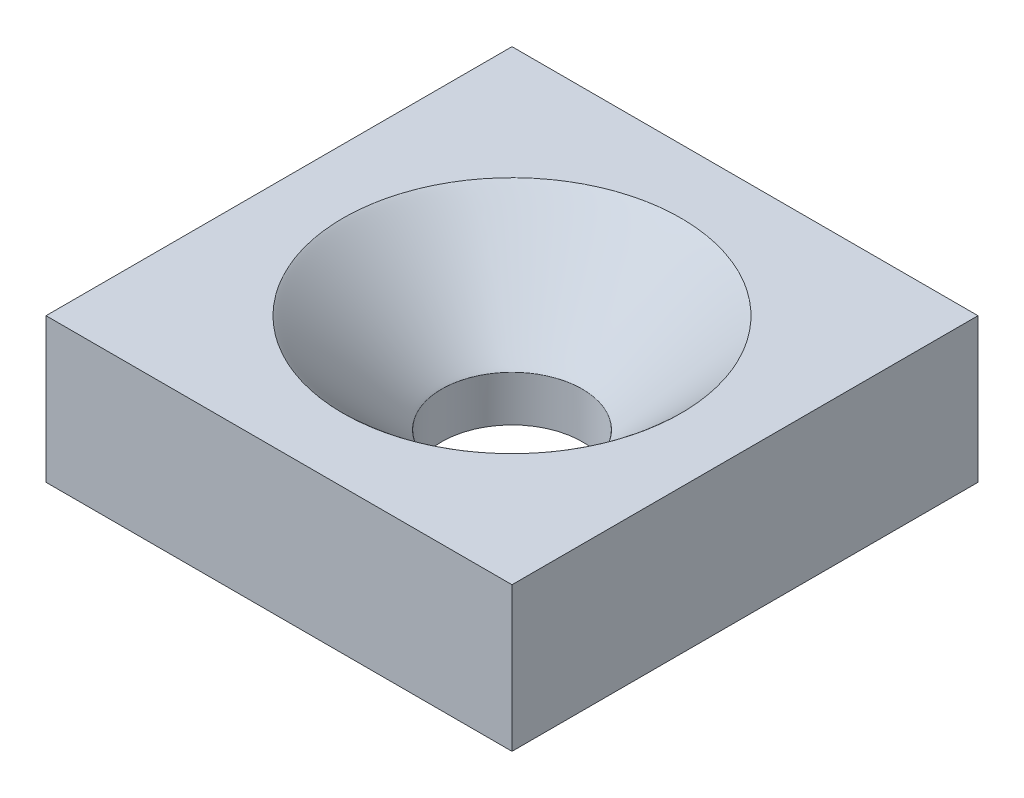
ISO-10303-21;
HEADER;
FILE_DESCRIPTION(('STEP AP214'),'2;1');
FILE_NAME('part.step','',(''),(''),'','','');
FILE_SCHEMA(('AUTOMOTIVE_DESIGN { 1 0 10303 214 1 1 1 1 }'));
ENDSEC;
DATA;
#1=APPLICATION_CONTEXT('core data for automotive mechanical design processes');
#2=APPLICATION_PROTOCOL_DEFINITION('international standard','automotive_design',2000,#1);
#3=PRODUCT_CONTEXT('',#1,'mechanical');
#4=PRODUCT('Part','Part','',(#3));
#5=PRODUCT_RELATED_PRODUCT_CATEGORY('part','',(#4));
#6=PRODUCT_DEFINITION_FORMATION('','',#4);
#7=PRODUCT_DEFINITION_CONTEXT('part definition',#1,'design');
#8=PRODUCT_DEFINITION('design','',#6,#7);
#9=PRODUCT_DEFINITION_SHAPE('','',#8);
#10=(LENGTH_UNIT() NAMED_UNIT(*) SI_UNIT(.MILLI.,.METRE.));
#11=(NAMED_UNIT(*) PLANE_ANGLE_UNIT() SI_UNIT($,.RADIAN.));
#12=(NAMED_UNIT(*) SI_UNIT($,.STERADIAN.) SOLID_ANGLE_UNIT());
#13=UNCERTAINTY_MEASURE_WITH_UNIT(LENGTH_MEASURE(1.E-05),#10,'distance_accuracy_value','');
#14=(GEOMETRIC_REPRESENTATION_CONTEXT(3) GLOBAL_UNCERTAINTY_ASSIGNED_CONTEXT((#13)) GLOBAL_UNIT_ASSIGNED_CONTEXT((#10,
#11,#12)) REPRESENTATION_CONTEXT('',''));
#15=CARTESIAN_POINT('',(0.,0.,0.));
#16=DIRECTION('',(0.,0.,1.));
#17=DIRECTION('',(1.,0.,0.));
#18=AXIS2_PLACEMENT_3D('',#15,#16,#17);
#19=CARTESIAN_POINT('',(7.78897368234957,10.,-7.78897368234957));
#20=DIRECTION('',(-1.,0.,0.));
#21=DIRECTION('',(0.,0.,1.));
#22=AXIS2_PLACEMENT_3D('',#19,#20,#21);
#23=PLANE('',#22);
#24=DIRECTION('',(0.,-1.,0.));
#25=VECTOR('',#24,1.);
#26=CARTESIAN_POINT('',(7.78897368234957,10.,7.78897368234957));
#27=LINE('',#26,#25);
#28=CARTESIAN_POINT('',(7.78897368234957,10.,7.78897368234957));
#29=VERTEX_POINT('',#28);
#30=CARTESIAN_POINT('',(7.78897368234957,5.17592294650626,7.78897368234957));
#31=VERTEX_POINT('',#30);
#32=EDGE_CURVE('E106',#29,#31,#27,.T.);
#33=ORIENTED_EDGE('',*,*,#32,.T.);
#34=DIRECTION('',(0.,0.,-1.));
#35=VECTOR('',#34,1.);
#36=CARTESIAN_POINT('',(7.78897368234957,5.17592294650626,-8.8812983625397));
#37=LINE('',#36,#35);
#38=CARTESIAN_POINT('',(7.78897368234957,5.17592294650626,-7.78897368234957));
#39=VERTEX_POINT('',#38);
#40=EDGE_CURVE('E65',#31,#39,#37,.T.);
#41=ORIENTED_EDGE('',*,*,#40,.T.);
#42=DIRECTION('',(0.,-1.,0.));
#43=VECTOR('',#42,1.);
#44=CARTESIAN_POINT('',(7.78897368234957,10.,-7.78897368234957));
#45=LINE('',#44,#43);
#46=CARTESIAN_POINT('',(7.78897368234957,10.,-7.78897368234957));
#47=VERTEX_POINT('',#46);
#48=EDGE_CURVE('E105',#47,#39,#45,.T.);
#49=ORIENTED_EDGE('',*,*,#48,.F.);
#50=DIRECTION('',(0.,0.,-1.));
#51=VECTOR('',#50,1.);
#52=CARTESIAN_POINT('',(7.78897368234957,10.,-7.78897368234957));
#53=LINE('',#52,#51);
#54=EDGE_CURVE('E99',#29,#47,#53,.T.);
#55=ORIENTED_EDGE('',*,*,#54,.F.);
#56=EDGE_LOOP('',(#33,#41,#49,#55));
#57=FACE_BOUND('',#56,.T.);
#58=ADVANCED_FACE('F44',(#57),#23,.F.);
#59=CARTESIAN_POINT('',(-7.78897368234957,10.,-7.78897368234957));
#60=DIRECTION('',(0.,0.,1.));
#61=DIRECTION('',(1.,0.,0.));
#62=AXIS2_PLACEMENT_3D('',#59,#60,#61);
#63=PLANE('',#62);
#64=ORIENTED_EDGE('',*,*,#48,.T.);
#65=DIRECTION('',(-1.,0.,0.));
#66=VECTOR('',#65,1.);
#67=CARTESIAN_POINT('',(-7.78897368234957,5.17592294650626,-7.78897368234957));
#68=LINE('',#67,#66);
#69=CARTESIAN_POINT('',(-7.78897368234957,5.17592294650626,-7.78897368234957));
#70=VERTEX_POINT('',#69);
#71=EDGE_CURVE('E90',#39,#70,#68,.T.);
#72=ORIENTED_EDGE('',*,*,#71,.T.);
#73=DIRECTION('',(0.,-1.,0.));
#74=VECTOR('',#73,1.);
#75=CARTESIAN_POINT('',(-7.78897368234957,10.,-7.78897368234957));
#76=LINE('',#75,#74);
#77=CARTESIAN_POINT('',(-7.78897368234957,10.,-7.78897368234957));
#78=VERTEX_POINT('',#77);
#79=EDGE_CURVE('E112',#78,#70,#76,.T.);
#80=ORIENTED_EDGE('',*,*,#79,.F.);
#81=DIRECTION('',(-1.,0.,0.));
#82=VECTOR('',#81,1.);
#83=CARTESIAN_POINT('',(-7.78897368234957,10.,-7.78897368234957));
#84=LINE('',#83,#82);
#85=EDGE_CURVE('E110',#47,#78,#84,.T.);
#86=ORIENTED_EDGE('',*,*,#85,.F.);
#87=EDGE_LOOP('',(#64,#72,#80,#86));
#88=FACE_BOUND('',#87,.T.);
#89=ADVANCED_FACE('F109',(#88),#63,.F.);
#90=CARTESIAN_POINT('',(-7.78897368234957,10.,-7.78897368234957));
#91=DIRECTION('',(1.,0.,0.));
#92=DIRECTION('',(0.,0.,-1.));
#93=AXIS2_PLACEMENT_3D('',#90,#91,#92);
#94=PLANE('',#93);
#95=ORIENTED_EDGE('',*,*,#79,.T.);
#96=DIRECTION('',(0.,0.,1.));
#97=VECTOR('',#96,1.);
#98=CARTESIAN_POINT('',(-7.78897368234957,5.17592294650626,-7.78897368234957));
#99=LINE('',#98,#97);
#100=CARTESIAN_POINT('',(-7.78897368234957,5.17592294650626,7.78897368234957));
#101=VERTEX_POINT('',#100);
#102=EDGE_CURVE('E93',#70,#101,#99,.T.);
#103=ORIENTED_EDGE('',*,*,#102,.T.);
#104=DIRECTION('',(0.,-1.,0.));
#105=VECTOR('',#104,1.);
#106=CARTESIAN_POINT('',(-7.78897368234957,10.,7.78897368234957));
#107=LINE('',#106,#105);
#108=CARTESIAN_POINT('',(-7.78897368234957,10.,7.78897368234957));
#109=VERTEX_POINT('',#108);
#110=EDGE_CURVE('E117',#109,#101,#107,.T.);
#111=ORIENTED_EDGE('',*,*,#110,.F.);
#112=DIRECTION('',(0.,0.,1.));
#113=VECTOR('',#112,1.);
#114=CARTESIAN_POINT('',(-7.78897368234957,10.,-7.78897368234957));
#115=LINE('',#114,#113);
#116=EDGE_CURVE('E177',#78,#109,#115,.T.);
#117=ORIENTED_EDGE('',*,*,#116,.F.);
#118=EDGE_LOOP('',(#95,#103,#111,#117));
#119=FACE_BOUND('',#118,.T.);
#120=ADVANCED_FACE('F193',(#119),#94,.F.);
#121=CARTESIAN_POINT('',(-7.78897368234957,10.,7.78897368234957));
#122=DIRECTION('',(0.,0.,-1.));
#123=DIRECTION('',(-1.,0.,0.));
#124=AXIS2_PLACEMENT_3D('',#121,#122,#123);
#125=PLANE('',#124);
#126=ORIENTED_EDGE('',*,*,#110,.T.);
#127=DIRECTION('',(1.,0.,0.));
#128=VECTOR('',#127,1.);
#129=CARTESIAN_POINT('',(-7.78897368234957,5.17592294650626,7.78897368234957));
#130=LINE('',#129,#128);
#131=EDGE_CURVE('E190',#101,#31,#130,.T.);
#132=ORIENTED_EDGE('',*,*,#131,.T.);
#133=ORIENTED_EDGE('',*,*,#32,.F.);
#134=DIRECTION('',(1.,0.,0.));
#135=VECTOR('',#134,1.);
#136=CARTESIAN_POINT('',(-7.78897368234957,10.,7.78897368234957));
#137=LINE('',#136,#135);
#138=EDGE_CURVE('E73',#109,#29,#137,.T.);
#139=ORIENTED_EDGE('',*,*,#138,.F.);
#140=EDGE_LOOP('',(#126,#132,#133,#139));
#141=FACE_BOUND('',#140,.T.);
#142=ADVANCED_FACE('F144',(#141),#125,.F.);
#143=CARTESIAN_POINT('',(0.,10.,0.));
#144=DIRECTION('',(0.,1.,0.));
#145=DIRECTION('',(0.,0.,1.));
#146=AXIS2_PLACEMENT_3D('',#143,#144,#145);
#147=PLANE('',#146);
#148=CARTESIAN_POINT('',(0.,10.,5.65));
#149=CARTESIAN_POINT('',(0.369791633335737,10.,5.65));
#150=CARTESIAN_POINT('',(0.739574128599286,10.,5.61357960310465));
#151=CARTESIAN_POINT('',(1.46494651018296,10.,5.46929406545186));
#152=CARTESIAN_POINT('',(1.82051847153007,10.,5.36143249019358));
#153=CARTESIAN_POINT('',(2.50380431419545,10.,5.07840622718397));
#154=CARTESIAN_POINT('',(2.83150131055834,10.,4.90324853341021));
#155=CARTESIAN_POINT('',(3.44644232256316,10.,4.49235808560855));
#156=CARTESIAN_POINT('',(3.73367114214627,10.,4.25663548526156));
#157=CARTESIAN_POINT('',(4.25663548526172,10.,3.73367114214643));
#158=CARTESIAN_POINT('',(4.49235808560839,10.,3.44644232256308));
#159=CARTESIAN_POINT('',(4.90324853341037,10.,2.83150131055842));
#160=CARTESIAN_POINT('',(5.07840622718406,10.,2.50380431419547));
#161=CARTESIAN_POINT('',(5.36143249019349,10.,1.82051847153004));
#162=CARTESIAN_POINT('',(5.46929406545189,10.,1.46494651018296));
#163=CARTESIAN_POINT('',(5.61357960310462,10.,0.7395741285993));
#164=CARTESIAN_POINT('',(5.65,10.,0.369791633335625));
#165=CARTESIAN_POINT('',(5.65,10.,-0.369791633335624));
#166=CARTESIAN_POINT('',(5.61357960310446,10.,-0.739574128599252));
#167=CARTESIAN_POINT('',(5.46929406545205,10.,-1.46494651018299));
#168=CARTESIAN_POINT('',(5.36143249019349,10.,-1.82051847153013));
#169=CARTESIAN_POINT('',(5.07840622718405,10.,-2.50380431419539));
#170=CARTESIAN_POINT('',(4.90324853341034,10.,-2.83150131055847));
#171=CARTESIAN_POINT('',(4.49235808560843,10.,-3.44644232256303));
#172=CARTESIAN_POINT('',(4.25663548526172,10.,-3.73367114214627));
#173=CARTESIAN_POINT('',(3.73367114214626,10.,-4.25663548526172));
#174=CARTESIAN_POINT('',(3.44644232256312,10.,-4.49235808560842));
#175=CARTESIAN_POINT('',(2.8315013105584,10.,-4.90324853341033));
#176=CARTESIAN_POINT('',(2.50380431419543,10.,-5.07840622718403));
#177=CARTESIAN_POINT('',(1.8205184715301,10.,-5.3614324901935));
#178=CARTESIAN_POINT('',(1.46494651018297,10.,-5.46929406545196));
#179=CARTESIAN_POINT('',(0.739574128599286,10.,-5.61357960310455));
#180=CARTESIAN_POINT('',(0.369791633335626,10.,-5.65));
#181=CARTESIAN_POINT('',(-0.369791633335624,10.,-5.65));
#182=CARTESIAN_POINT('',(-0.739574128599278,10.,-5.61357960310455));
#183=CARTESIAN_POINT('',(-1.46494651018296,10.,-5.46929406545196));
#184=CARTESIAN_POINT('',(-1.82051847153001,10.,-5.36143249019367));
#185=CARTESIAN_POINT('',(-2.50380431419549,10.,-5.07840622718388));
#186=CARTESIAN_POINT('',(-2.83150131055839,10.,-4.90324853341034));
#187=CARTESIAN_POINT('',(-3.44644232256311,10.,-4.49235808560843));
#188=CARTESIAN_POINT('',(-3.73367114214627,10.,-4.25663548526156));
#189=CARTESIAN_POINT('',(-4.25663548526172,10.,-3.73367114214643));
#190=CARTESIAN_POINT('',(-4.49235808560826,10.,-3.44644232256296));
#191=CARTESIAN_POINT('',(-4.90324853341049,10.,-2.83150131055856));
#192=CARTESIAN_POINT('',(-5.07840622718403,10.,-2.50380431419543));
#193=CARTESIAN_POINT('',(-5.3614324901935,10.,-1.8205184715301));
#194=CARTESIAN_POINT('',(-5.46929406545196,10.,-1.46494651018297));
#195=CARTESIAN_POINT('',(-5.61357960310455,10.,-0.739574128599289));
#196=CARTESIAN_POINT('',(-5.65,10.,-0.369791633335616));
#197=CARTESIAN_POINT('',(-5.65,10.,0.369791633335634));
#198=CARTESIAN_POINT('',(-5.61357960310455,10.,0.739574128599277));
#199=CARTESIAN_POINT('',(-5.46929406545196,10.,1.46494651018296));
#200=CARTESIAN_POINT('',(-5.36143249019367,10.,1.82051847153001));
#201=CARTESIAN_POINT('',(-5.07840622718388,10.,2.50380431419549));
#202=CARTESIAN_POINT('',(-4.9032485334105,10.,2.83150131055839));
#203=CARTESIAN_POINT('',(-4.49235808560827,10.,3.44644232256311));
#204=CARTESIAN_POINT('',(-4.25663548526173,10.,3.73367114214642));
#205=CARTESIAN_POINT('',(-3.73367114214628,10.,4.25663548526155));
#206=CARTESIAN_POINT('',(-3.44644232256304,10.,4.49235808560826));
#207=CARTESIAN_POINT('',(-2.83150131055848,10.,4.90324853341049));
#208=CARTESIAN_POINT('',(-2.50380431419551,10.,5.07840622718403));
#209=CARTESIAN_POINT('',(-1.82051847153002,10.,5.3614324901935));
#210=CARTESIAN_POINT('',(-1.46494651018293,10.,5.46929406545196));
#211=CARTESIAN_POINT('',(-0.739574128599329,10.,5.61357960310455));
#212=CARTESIAN_POINT('',(-0.369791633335738,10.,5.65));
#213=CARTESIAN_POINT('',(0.,10.,5.65));
#214=(BOUNDED_CURVE() B_SPLINE_CURVE(3,(#148,#149,#150,#151,#152,#153,#154,#155,#156,#157,#158,
#159,#160,#161,#162,#163,#164,#165,#166,#167,#168,#169,#170,#171,#172,#173,#174,#175,#176,#177,
#178,#179,#180,#181,#182,#183,#184,#185,#186,#187,#188,#189,#190,#191,#192,#193,#194,#195,#196,
#197,#198,#199,#200,#201,#202,#203,#204,#205,#206,#207,#208,#209,#210,#211,#212,#213),
.UNSPECIFIED.,.T.,.F.) B_SPLINE_CURVE_WITH_KNOTS((4,2,2,2,2,2,2,2,2,2,2,2,2,2,2,2,2,2,2,2,2,2,2,
2,2,2,2,2,2,2,2,2,4),(0.,0.196349540849362,0.392699081698724,0.589048622548086,
0.785398163397448,0.98174770424681,1.17809724509617,1.37444678594553,1.5707963267949,
1.76714586764426,1.96349540849362,2.15984494934298,2.35619449019234,2.55254403104171,
2.74889357189107,2.94524311274043,3.14159265358979,3.33794219443916,3.53429173528852,
3.73064127613788,3.92699081698724,4.1233403578366,4.31968989868597,4.51603943953533,
4.71238898038469,4.90873852123405,5.10508806208341,5.30143760293278,5.49778714378214,
5.6941366846315,5.89048622548086,6.08683576633022,6.28318530717959),
.UNSPECIFIED.) CURVE() GEOMETRIC_REPRESENTATION_ITEM() RATIONAL_B_SPLINE_CURVE((1.,1.,1.,1.,1.,
1.,1.,1.,1.,1.,1.,1.,1.,1.,1.,1.,1.,1.,1.,1.,1.,1.,1.,1.,1.,1.,1.,1.,1.,1.,1.,1.,1.,1.,1.,1.,1.,
1.,1.,1.,1.,1.,1.,1.,1.,1.,1.,1.,1.,1.,1.,1.,1.,1.,1.,1.,1.,1.,1.,1.,1.,1.,1.,1.,1.,1.)) REPRESENTATION_ITEM(''));
#215=CARTESIAN_POINT('',(0.,10.,5.65));
#216=VERTEX_POINT('',#215);
#217=EDGE_CURVE('E12',#216,#216,#214,.F.);
#218=ORIENTED_EDGE('',*,*,#217,.T.);
#219=EDGE_LOOP('',(#218));
#220=FACE_BOUND('',#219,.T.);
#221=ORIENTED_EDGE('',*,*,#54,.T.);
#222=ORIENTED_EDGE('',*,*,#85,.T.);
#223=ORIENTED_EDGE('',*,*,#116,.T.);
#224=ORIENTED_EDGE('',*,*,#138,.T.);
#225=EDGE_LOOP('',(#221,#222,#223,#224));
#226=FACE_BOUND('',#225,.T.);
#227=ADVANCED_FACE('F139',(#220,#226),#147,.T.);
#228=CARTESIAN_POINT('',(0.,0.,0.));
#229=DIRECTION('',(0.,1.,0.));
#230=DIRECTION('',(0.,0.,1.));
#231=AXIS2_PLACEMENT_3D('',#228,#229,#230);
#232=CYLINDRICAL_SURFACE('',#231,2.35);
#233=CARTESIAN_POINT('',(0.,5.17592294650626,0.));
#234=DIRECTION('',(0.,1.,0.));
#235=DIRECTION('',(0.,0.,1.));
#236=AXIS2_PLACEMENT_3D('',#233,#234,#235);
#237=CIRCLE('',#236,2.35);
#238=CARTESIAN_POINT('',(0.,5.17592294650626,2.35));
#239=VERTEX_POINT('',#238);
#240=EDGE_CURVE('E52',#239,#239,#237,.F.);
#241=ORIENTED_EDGE('',*,*,#240,.T.);
#242=EDGE_LOOP('',(#241));
#243=FACE_BOUND('',#242,.T.);
#244=CARTESIAN_POINT('',(0.,6.7,2.35));
#245=CARTESIAN_POINT('',(-0.153807139529024,6.7,2.35));
#246=CARTESIAN_POINT('',(-0.30761047826699,6.7,2.33485169332667));
#247=CARTESIAN_POINT('',(-0.609314035208819,6.7,2.27483912456851));
#248=CARTESIAN_POINT('',(-0.757206797893038,6.7,2.22997634547873));
#249=CARTESIAN_POINT('',(-1.04140533422289,6.7,2.11225745732432));
#250=CARTESIAN_POINT('',(-1.1777040849225,6.7,2.0394042572592));
#251=CARTESIAN_POINT('',(-1.43347601026963,6.7,1.86850292056276));
#252=CARTESIAN_POINT('',(-1.55294286443258,6.7,1.7704590071442));
#253=CARTESIAN_POINT('',(-1.7704590071442,6.7,1.55294286443257));
#254=CARTESIAN_POINT('',(-1.86850292056273,6.7,1.43347601026968));
#255=CARTESIAN_POINT('',(-2.03940425725923,6.7,1.17770408492245));
#256=CARTESIAN_POINT('',(-2.11225745732431,6.7,1.04140533422291));
#257=CARTESIAN_POINT('',(-2.22997634547874,6.7,0.757206797893009));
#258=CARTESIAN_POINT('',(-2.27483912456851,6.7,0.609314035208837));
#259=CARTESIAN_POINT('',(-2.33485169332668,6.7,0.307610478266962));
#260=CARTESIAN_POINT('',(-2.35,6.7,0.153807139528981));
#261=CARTESIAN_POINT('',(-2.35,6.7,-0.153807139528973));
#262=CARTESIAN_POINT('',(-2.33485169332667,6.7,-0.307610478266982));
#263=CARTESIAN_POINT('',(-2.27483912456851,6.7,-0.609314035208827));
#264=CARTESIAN_POINT('',(-2.22997634547873,6.7,-0.757206797893033));
#265=CARTESIAN_POINT('',(-2.11225745732432,6.7,-1.0414053342229));
#266=CARTESIAN_POINT('',(-2.03940425725919,6.7,-1.17770408492252));
#267=CARTESIAN_POINT('',(-1.86850292056277,6.7,-1.43347601026961));
#268=CARTESIAN_POINT('',(-1.7704590071442,6.7,-1.55294286443257));
#269=CARTESIAN_POINT('',(-1.55294286443258,6.7,-1.7704590071442));
#270=CARTESIAN_POINT('',(-1.43347601026957,6.7,-1.8685029205628));
#271=CARTESIAN_POINT('',(-1.17770408492255,6.7,-2.03940425725917));
#272=CARTESIAN_POINT('',(-1.04140533422291,6.7,-2.11225745732431));
#273=CARTESIAN_POINT('',(-0.75720679789301,6.7,-2.22997634547874));
#274=CARTESIAN_POINT('',(-0.609314035208856,6.7,-2.2748391245685));
#275=CARTESIAN_POINT('',(-0.307610478266943,6.7,-2.33485169332668));
#276=CARTESIAN_POINT('',(-0.153807139528976,6.7,-2.35));
#277=CARTESIAN_POINT('',(0.153807139528977,6.7,-2.35));
#278=CARTESIAN_POINT('',(0.307610478266978,6.7,-2.33485169332667));
#279=CARTESIAN_POINT('',(0.609314035208829,6.7,-2.27483912456851));
#280=CARTESIAN_POINT('',(0.757206797893044,6.7,-2.22997634547872));
#281=CARTESIAN_POINT('',(1.04140533422288,6.7,-2.11225745732432));
#282=CARTESIAN_POINT('',(1.17770408492252,6.7,-2.03940425725919));
#283=CARTESIAN_POINT('',(1.43347601026961,6.7,-1.86850292056277));
#284=CARTESIAN_POINT('',(1.55294286443253,6.7,-1.77045900714424));
#285=CARTESIAN_POINT('',(1.77045900714424,6.7,-1.55294286443254));
#286=CARTESIAN_POINT('',(1.86850292056278,6.7,-1.4334760102696));
#287=CARTESIAN_POINT('',(2.03940425725919,6.7,-1.17770408492253));
#288=CARTESIAN_POINT('',(2.11225745732433,6.7,-1.04140533422287));
#289=CARTESIAN_POINT('',(2.22997634547872,6.7,-0.757206797893049));
#290=CARTESIAN_POINT('',(2.2748391245685,6.7,-0.609314035208849));
#291=CARTESIAN_POINT('',(2.33485169332668,6.7,-0.307610478266951));
#292=CARTESIAN_POINT('',(2.35,6.7,-0.153807139528977));
#293=CARTESIAN_POINT('',(2.35,6.7,0.153807139528977));
#294=CARTESIAN_POINT('',(2.33485169332668,6.7,0.307610478266966));
#295=CARTESIAN_POINT('',(2.27483912456851,6.7,0.60931403520884));
#296=CARTESIAN_POINT('',(2.22997634547872,6.7,0.757206797893048));
#297=CARTESIAN_POINT('',(2.11225745732433,6.7,1.04140533422287));
#298=CARTESIAN_POINT('',(2.03940425725918,6.7,1.17770408492253));
#299=CARTESIAN_POINT('',(1.86850292056278,6.7,1.4334760102696));
#300=CARTESIAN_POINT('',(1.77045900714421,6.7,1.55294286443256));
#301=CARTESIAN_POINT('',(1.55294286443256,6.7,1.77045900714421));
#302=CARTESIAN_POINT('',(1.43347601026954,6.7,1.86850292056282));
#303=CARTESIAN_POINT('',(1.17770408492259,6.7,2.03940425725914));
#304=CARTESIAN_POINT('',(1.04140533422289,6.7,2.11225745732432));
#305=CARTESIAN_POINT('',(0.757206797893028,6.7,2.22997634547873));
#306=CARTESIAN_POINT('',(0.60931403520884,6.7,2.27483912456851));
#307=CARTESIAN_POINT('',(0.307610478266963,6.7,2.33485169332668));
#308=CARTESIAN_POINT('',(0.153807139529023,6.7,2.35));
#309=CARTESIAN_POINT('',(0.,6.7,2.35));
#310=(BOUNDED_CURVE() B_SPLINE_CURVE(3,(#244,#245,#246,#247,#248,#249,#250,#251,#252,#253,#254,
#255,#256,#257,#258,#259,#260,#261,#262,#263,#264,#265,#266,#267,#268,#269,#270,#271,#272,#273,
#274,#275,#276,#277,#278,#279,#280,#281,#282,#283,#284,#285,#286,#287,#288,#289,#290,#291,#292,
#293,#294,#295,#296,#297,#298,#299,#300,#301,#302,#303,#304,#305,#306,#307,#308,#309),
.UNSPECIFIED.,.T.,.F.) B_SPLINE_CURVE_WITH_KNOTS((4,2,2,2,2,2,2,2,2,2,2,2,2,2,2,2,2,2,2,2,2,2,2,
2,2,2,2,2,2,2,2,2,4),(0.,0.196349540849362,0.392699081698725,0.589048622548086,
0.785398163397448,0.981747704246811,1.17809724509617,1.37444678594553,1.5707963267949,
1.76714586764426,1.96349540849362,2.15984494934298,2.35619449019234,2.55254403104171,
2.74889357189107,2.94524311274043,3.14159265358979,3.33794219443916,3.53429173528852,
3.73064127613788,3.92699081698724,4.1233403578366,4.31968989868597,4.51603943953533,
4.71238898038469,4.90873852123405,5.10508806208341,5.30143760293278,5.49778714378214,
5.6941366846315,5.89048622548086,6.08683576633022,6.28318530717959),
.UNSPECIFIED.) CURVE() GEOMETRIC_REPRESENTATION_ITEM() RATIONAL_B_SPLINE_CURVE((1.,1.,1.,1.,1.,
1.,1.,1.,1.,1.,1.,1.,1.,1.,1.,1.,1.,1.,1.,1.,1.,1.,1.,1.,1.,1.,1.,1.,1.,1.,1.,1.,1.,1.,1.,1.,1.,
1.,1.,1.,1.,1.,1.,1.,1.,1.,1.,1.,1.,1.,1.,1.,1.,1.,1.,1.,1.,1.,1.,1.,1.,1.,1.,1.,1.,1.)) REPRESENTATION_ITEM(''));
#311=CARTESIAN_POINT('',(0.,6.7,2.35));
#312=VERTEX_POINT('',#311);
#313=EDGE_CURVE('E58',#312,#312,#310,.F.);
#314=ORIENTED_EDGE('',*,*,#313,.T.);
#315=EDGE_LOOP('',(#314));
#316=FACE_BOUND('',#315,.T.);
#317=ADVANCED_FACE('F129',(#243,#316),#232,.F.);
#318=CARTESIAN_POINT('',(0.,6.7,2.35));
#319=CARTESIAN_POINT('',(0.153807139529023,6.7,2.35));
#320=CARTESIAN_POINT('',(0.307610478266963,6.7,2.33485169332668));
#321=CARTESIAN_POINT('',(0.60931403520884,6.7,2.27483912456851));
#322=CARTESIAN_POINT('',(0.757206797893028,6.7,2.22997634547873));
#323=CARTESIAN_POINT('',(1.04140533422289,6.7,2.11225745732432));
#324=CARTESIAN_POINT('',(1.17770408492259,6.7,2.03940425725914));
#325=CARTESIAN_POINT('',(1.43347601026954,6.7,1.86850292056282));
#326=CARTESIAN_POINT('',(1.55294286443256,6.7,1.77045900714421));
#327=CARTESIAN_POINT('',(1.77045900714421,6.7,1.55294286443256));
#328=CARTESIAN_POINT('',(1.86850292056278,6.7,1.4334760102696));
#329=CARTESIAN_POINT('',(2.03940425725918,6.7,1.17770408492253));
#330=CARTESIAN_POINT('',(2.11225745732433,6.7,1.04140533422287));
#331=CARTESIAN_POINT('',(2.22997634547872,6.7,0.757206797893048));
#332=CARTESIAN_POINT('',(2.27483912456851,6.7,0.60931403520884));
#333=CARTESIAN_POINT('',(2.33485169332668,6.7,0.307610478266966));
#334=CARTESIAN_POINT('',(2.35,6.7,0.153807139528977));
#335=CARTESIAN_POINT('',(2.35,6.7,-0.153807139528977));
#336=CARTESIAN_POINT('',(2.33485169332668,6.7,-0.307610478266951));
#337=CARTESIAN_POINT('',(2.2748391245685,6.7,-0.609314035208849));
#338=CARTESIAN_POINT('',(2.22997634547872,6.7,-0.757206797893049));
#339=CARTESIAN_POINT('',(2.11225745732433,6.7,-1.04140533422287));
#340=CARTESIAN_POINT('',(2.03940425725919,6.7,-1.17770408492253));
#341=CARTESIAN_POINT('',(1.86850292056278,6.7,-1.4334760102696));
#342=CARTESIAN_POINT('',(1.77045900714424,6.7,-1.55294286443254));
#343=CARTESIAN_POINT('',(1.55294286443253,6.7,-1.77045900714424));
#344=CARTESIAN_POINT('',(1.43347601026961,6.7,-1.86850292056277));
#345=CARTESIAN_POINT('',(1.17770408492252,6.7,-2.03940425725919));
#346=CARTESIAN_POINT('',(1.04140533422288,6.7,-2.11225745732432));
#347=CARTESIAN_POINT('',(0.757206797893044,6.7,-2.22997634547872));
#348=CARTESIAN_POINT('',(0.609314035208829,6.7,-2.27483912456851));
#349=CARTESIAN_POINT('',(0.307610478266978,6.7,-2.33485169332667));
#350=CARTESIAN_POINT('',(0.153807139528977,6.7,-2.35));
#351=CARTESIAN_POINT('',(-0.153807139528976,6.7,-2.35));
#352=CARTESIAN_POINT('',(-0.307610478266943,6.7,-2.33485169332668));
#353=CARTESIAN_POINT('',(-0.609314035208856,6.7,-2.2748391245685));
#354=CARTESIAN_POINT('',(-0.75720679789301,6.7,-2.22997634547874));
#355=CARTESIAN_POINT('',(-1.04140533422291,6.7,-2.11225745732431));
#356=CARTESIAN_POINT('',(-1.17770408492255,6.7,-2.03940425725917));
#357=CARTESIAN_POINT('',(-1.43347601026957,6.7,-1.8685029205628));
#358=CARTESIAN_POINT('',(-1.55294286443258,6.7,-1.7704590071442));
#359=CARTESIAN_POINT('',(-1.7704590071442,6.7,-1.55294286443257));
#360=CARTESIAN_POINT('',(-1.86850292056277,6.7,-1.43347601026961));
#361=CARTESIAN_POINT('',(-2.03940425725919,6.7,-1.17770408492252));
#362=CARTESIAN_POINT('',(-2.11225745732432,6.7,-1.0414053342229));
#363=CARTESIAN_POINT('',(-2.22997634547873,6.7,-0.757206797893033));
#364=CARTESIAN_POINT('',(-2.27483912456851,6.7,-0.609314035208827));
#365=CARTESIAN_POINT('',(-2.33485169332667,6.7,-0.307610478266982));
#366=CARTESIAN_POINT('',(-2.35,6.7,-0.153807139528973));
#367=CARTESIAN_POINT('',(-2.35,6.7,0.153807139528981));
#368=CARTESIAN_POINT('',(-2.33485169332668,6.7,0.307610478266962));
#369=CARTESIAN_POINT('',(-2.27483912456851,6.7,0.609314035208837));
#370=CARTESIAN_POINT('',(-2.22997634547874,6.7,0.757206797893009));
#371=CARTESIAN_POINT('',(-2.11225745732431,6.7,1.04140533422291));
#372=CARTESIAN_POINT('',(-2.03940425725923,6.7,1.17770408492245));
#373=CARTESIAN_POINT('',(-1.86850292056273,6.7,1.43347601026968));
#374=CARTESIAN_POINT('',(-1.7704590071442,6.7,1.55294286443257));
#375=CARTESIAN_POINT('',(-1.55294286443258,6.7,1.7704590071442));
#376=CARTESIAN_POINT('',(-1.43347601026963,6.7,1.86850292056276));
#377=CARTESIAN_POINT('',(-1.1777040849225,6.7,2.0394042572592));
#378=CARTESIAN_POINT('',(-1.04140533422289,6.7,2.11225745732432));
#379=CARTESIAN_POINT('',(-0.757206797893038,6.7,2.22997634547873));
#380=CARTESIAN_POINT('',(-0.609314035208819,6.7,2.27483912456851));
#381=CARTESIAN_POINT('',(-0.30761047826699,6.7,2.33485169332667));
#382=CARTESIAN_POINT('',(-0.153807139529024,6.7,2.35));
#383=CARTESIAN_POINT('',(0.,6.7,2.35));
#384=CARTESIAN_POINT('',(0.,10.,2.35));
#385=CARTESIAN_POINT('',(0.153807139529023,9.99999999999968,2.35000000000024));
#386=CARTESIAN_POINT('',(0.307610478266988,10.,2.33485169332661));
#387=CARTESIAN_POINT('',(0.609314035208814,10.,2.27483912456858));
#388=CARTESIAN_POINT('',(0.757206797893079,9.99999999999968,2.2299763454786));
#389=CARTESIAN_POINT('',(1.04140533422284,10.0000000000003,2.11225745732445));
#390=CARTESIAN_POINT('',(1.1777040849225,10.,2.039404257259));
#391=CARTESIAN_POINT('',(1.43347601026963,10.,1.86850292056296));
#392=CARTESIAN_POINT('',(1.55294286443252,10.,1.77045900714417));
#393=CARTESIAN_POINT('',(1.77045900714425,10.,1.5529428644326));
#394=CARTESIAN_POINT('',(1.86850292056288,10.,1.43347601026963));
#395=CARTESIAN_POINT('',(2.03940425725908,10.,1.1777040849225));
#396=CARTESIAN_POINT('',(2.11225745732425,10.,1.04140533422283));
#397=CARTESIAN_POINT('',(2.2299763454788,10.,0.757206797893087));
#398=CARTESIAN_POINT('',(2.27483912456835,10.,0.609314035208825));
#399=CARTESIAN_POINT('',(2.33485169332683,10.,0.307610478266981));
#400=CARTESIAN_POINT('',(2.35,10.,0.153807139528977));
#401=CARTESIAN_POINT('',(2.35,10.,-0.153807139528977));
#402=CARTESIAN_POINT('',(2.33485169332651,10.0000000000003,-0.307610478266857));
#403=CARTESIAN_POINT('',(2.27483912456867,9.99999999999968,-0.609314035208942));
#404=CARTESIAN_POINT('',(2.2299763454788,10.,-0.757206797893048));
#405=CARTESIAN_POINT('',(2.11225745732425,10.,-1.04140533422288));
#406=CARTESIAN_POINT('',(2.03940425725922,10.,-1.1777040849225));
#407=CARTESIAN_POINT('',(1.86850292056275,10.,-1.43347601026963));
#408=CARTESIAN_POINT('',(1.77045900714424,10.,-1.55294286443262));
#409=CARTESIAN_POINT('',(1.55294286443253,10.,-1.77045900714416));
#410=CARTESIAN_POINT('',(1.43347601026952,10.,-1.86850292056274));
#411=CARTESIAN_POINT('',(1.17770408492262,10.,-2.03940425725922));
#412=CARTESIAN_POINT('',(1.04140533422298,9.99999999999968,-2.11225745732441));
#413=CARTESIAN_POINT('',(0.757206797892952,10.0000000000003,-2.22997634547863));
#414=CARTESIAN_POINT('',(0.609314035208774,10.0000000000006,-2.27483912456831));
#415=CARTESIAN_POINT('',(0.307610478267032,9.99999999999936,-2.33485169332687));
#416=CARTESIAN_POINT('',(0.153807139528977,10.,-2.35));
#417=CARTESIAN_POINT('',(-0.153807139528977,10.,-2.35));
#418=CARTESIAN_POINT('',(-0.307610478266888,10.0000000000003,-2.33485169332663));
#419=CARTESIAN_POINT('',(-0.609314035208911,9.99999999999968,-2.27483912456855));
#420=CARTESIAN_POINT('',(-0.757206797892987,10.0000000000003,-2.22997634547888));
#421=CARTESIAN_POINT('',(-1.04140533422293,9.99999999999968,-2.11225745732418));
#422=CARTESIAN_POINT('',(-1.1777040849225,10.,-2.03940425725898));
#423=CARTESIAN_POINT('',(-1.43347601026963,10.,-1.86850292056299));
#424=CARTESIAN_POINT('',(-1.55294286443254,10.,-1.77045900714408));
#425=CARTESIAN_POINT('',(-1.77045900714424,10.,-1.55294286443269));
#426=CARTESIAN_POINT('',(-1.86850292056266,10.,-1.4334760102696));
#427=CARTESIAN_POINT('',(-2.0394042572593,10.,-1.17770408492254));
#428=CARTESIAN_POINT('',(-2.11225745732449,9.99999999999968,-1.04140533422306));
#429=CARTESIAN_POINT('',(-2.22997634547855,10.0000000000003,-0.757206797892872));
#430=CARTESIAN_POINT('',(-2.27483912456847,10.0000000000003,-0.609314035208795));
#431=CARTESIAN_POINT('',(-2.33485169332671,9.99999999999968,-0.307610478267013));
#432=CARTESIAN_POINT('',(-2.35,10.,-0.153807139528973));
#433=CARTESIAN_POINT('',(-2.35,10.,0.153807139528981));
#434=CARTESIAN_POINT('',(-2.33485169332663,10.0000000000003,0.307610478266928));
#435=CARTESIAN_POINT('',(-2.27483912456855,9.99999999999968,0.609314035208871));
#436=CARTESIAN_POINT('',(-2.22997634547888,10.0000000000003,0.757206797892986));
#437=CARTESIAN_POINT('',(-2.11225745732418,9.99999999999968,1.04140533422293));
#438=CARTESIAN_POINT('',(-2.0394042572593,10.,1.17770408492242));
#439=CARTESIAN_POINT('',(-1.86850292056267,10.,1.43347601026971));
#440=CARTESIAN_POINT('',(-1.77045900714416,10.,1.55294286443261));
#441=CARTESIAN_POINT('',(-1.55294286443262,10.,1.77045900714415));
#442=CARTESIAN_POINT('',(-1.43347601026956,10.,1.86850292056258));
#443=CARTESIAN_POINT('',(-1.17770408492258,10.,2.03940425725938));
#444=CARTESIAN_POINT('',(-1.04140533422302,9.99999999999968,2.11225745732441));
#445=CARTESIAN_POINT('',(-0.757206797892912,10.0000000000003,2.22997634547863));
#446=CARTESIAN_POINT('',(-0.609314035208795,10.0000000000006,2.27483912456839));
#447=CARTESIAN_POINT('',(-0.307610478267013,9.99999999999936,2.33485169332679));
#448=CARTESIAN_POINT('',(-0.153807139529024,10.0000000000003,2.34999999999976));
#449=CARTESIAN_POINT('',(0.,10.,2.35));
#450=CARTESIAN_POINT('',(0.,10.,5.65));
#451=CARTESIAN_POINT('',(0.369791633335737,10.,5.65));
#452=CARTESIAN_POINT('',(0.739574128599286,10.,5.61357960310465));
#453=CARTESIAN_POINT('',(1.46494651018296,10.,5.46929406545186));
#454=CARTESIAN_POINT('',(1.82051847153007,10.,5.36143249019358));
#455=CARTESIAN_POINT('',(2.50380431419545,10.,5.07840622718397));
#456=CARTESIAN_POINT('',(2.83150131055834,10.,4.90324853341021));
#457=CARTESIAN_POINT('',(3.44644232256316,10.,4.49235808560855));
#458=CARTESIAN_POINT('',(3.73367114214627,10.,4.25663548526156));
#459=CARTESIAN_POINT('',(4.25663548526172,10.,3.73367114214643));
#460=CARTESIAN_POINT('',(4.49235808560839,10.,3.44644232256308));
#461=CARTESIAN_POINT('',(4.90324853341037,10.,2.83150131055842));
#462=CARTESIAN_POINT('',(5.07840622718406,10.,2.50380431419547));
#463=CARTESIAN_POINT('',(5.36143249019349,10.,1.82051847153004));
#464=CARTESIAN_POINT('',(5.46929406545189,10.,1.46494651018296));
#465=CARTESIAN_POINT('',(5.61357960310462,10.,0.7395741285993));
#466=CARTESIAN_POINT('',(5.65,10.,0.369791633335625));
#467=CARTESIAN_POINT('',(5.65,10.,-0.369791633335624));
#468=CARTESIAN_POINT('',(5.61357960310446,10.,-0.739574128599252));
#469=CARTESIAN_POINT('',(5.46929406545205,10.,-1.46494651018299));
#470=CARTESIAN_POINT('',(5.36143249019349,10.,-1.82051847153013));
#471=CARTESIAN_POINT('',(5.07840622718405,10.,-2.50380431419539));
#472=CARTESIAN_POINT('',(4.90324853341034,10.,-2.83150131055847));
#473=CARTESIAN_POINT('',(4.49235808560843,10.,-3.44644232256303));
#474=CARTESIAN_POINT('',(4.25663548526172,10.,-3.73367114214627));
#475=CARTESIAN_POINT('',(3.73367114214626,10.,-4.25663548526172));
#476=CARTESIAN_POINT('',(3.44644232256312,10.,-4.49235808560842));
#477=CARTESIAN_POINT('',(2.8315013105584,10.,-4.90324853341033));
#478=CARTESIAN_POINT('',(2.50380431419543,10.,-5.07840622718403));
#479=CARTESIAN_POINT('',(1.8205184715301,10.,-5.3614324901935));
#480=CARTESIAN_POINT('',(1.46494651018297,10.,-5.46929406545196));
#481=CARTESIAN_POINT('',(0.739574128599286,10.,-5.61357960310455));
#482=CARTESIAN_POINT('',(0.369791633335626,10.,-5.65));
#483=CARTESIAN_POINT('',(-0.369791633335624,10.,-5.65));
#484=CARTESIAN_POINT('',(-0.739574128599278,10.,-5.61357960310455));
#485=CARTESIAN_POINT('',(-1.46494651018296,10.,-5.46929406545196));
#486=CARTESIAN_POINT('',(-1.82051847153001,10.,-5.36143249019367));
#487=CARTESIAN_POINT('',(-2.50380431419549,10.,-5.07840622718388));
#488=CARTESIAN_POINT('',(-2.83150131055839,10.,-4.90324853341034));
#489=CARTESIAN_POINT('',(-3.44644232256311,10.,-4.49235808560843));
#490=CARTESIAN_POINT('',(-3.73367114214627,10.,-4.25663548526156));
#491=CARTESIAN_POINT('',(-4.25663548526172,10.,-3.73367114214643));
#492=CARTESIAN_POINT('',(-4.49235808560826,10.,-3.44644232256296));
#493=CARTESIAN_POINT('',(-4.90324853341049,10.,-2.83150131055856));
#494=CARTESIAN_POINT('',(-5.07840622718403,10.,-2.50380431419543));
#495=CARTESIAN_POINT('',(-5.3614324901935,10.,-1.8205184715301));
#496=CARTESIAN_POINT('',(-5.46929406545196,10.,-1.46494651018297));
#497=CARTESIAN_POINT('',(-5.61357960310455,10.,-0.739574128599289));
#498=CARTESIAN_POINT('',(-5.65,10.,-0.369791633335616));
#499=CARTESIAN_POINT('',(-5.65,10.,0.369791633335634));
#500=CARTESIAN_POINT('',(-5.61357960310455,10.,0.739574128599277));
#501=CARTESIAN_POINT('',(-5.46929406545196,10.,1.46494651018296));
#502=CARTESIAN_POINT('',(-5.36143249019367,10.,1.82051847153001));
#503=CARTESIAN_POINT('',(-5.07840622718388,10.,2.50380431419549));
#504=CARTESIAN_POINT('',(-4.9032485334105,10.,2.83150131055839));
#505=CARTESIAN_POINT('',(-4.49235808560827,10.,3.44644232256311));
#506=CARTESIAN_POINT('',(-4.25663548526173,10.,3.73367114214642));
#507=CARTESIAN_POINT('',(-3.73367114214628,10.,4.25663548526155));
#508=CARTESIAN_POINT('',(-3.44644232256304,10.,4.49235808560826));
#509=CARTESIAN_POINT('',(-2.83150131055848,10.,4.90324853341049));
#510=CARTESIAN_POINT('',(-2.50380431419551,10.,5.07840622718403));
#511=CARTESIAN_POINT('',(-1.82051847153002,10.,5.3614324901935));
#512=CARTESIAN_POINT('',(-1.46494651018293,10.,5.46929406545196));
#513=CARTESIAN_POINT('',(-0.739574128599329,10.,5.61357960310455));
#514=CARTESIAN_POINT('',(-0.369791633335738,10.,5.65));
#515=CARTESIAN_POINT('',(0.,10.,5.65));
#516=(BOUNDED_SURFACE() B_SPLINE_SURFACE(2,3,((#318,#319,#320,#321,#322,#323,#324,#325,#326,
#327,#328,#329,#330,#331,#332,#333,#334,#335,#336,#337,#338,#339,#340,#341,#342,#343,#344,#345,
#346,#347,#348,#349,#350,#351,#352,#353,#354,#355,#356,#357,#358,#359,#360,#361,#362,#363,#364,
#365,#366,#367,#368,#369,#370,#371,#372,#373,#374,#375,#376,#377,#378,#379,#380,#381,#382,#383),
(#384,#385,#386,#387,#388,#389,#390,#391,#392,#393,#394,#395,#396,#397,#398,#399,#400,#401,#402,
#403,#404,#405,#406,#407,#408,#409,#410,#411,#412,#413,#414,#415,#416,#417,#418,#419,#420,#421,
#422,#423,#424,#425,#426,#427,#428,#429,#430,#431,#432,#433,#434,#435,#436,#437,#438,#439,#440,
#441,#442,#443,#444,#445,#446,#447,#448,#449),(#450,#451,#452,#453,#454,#455,#456,#457,#458,
#459,#460,#461,#462,#463,#464,#465,#466,#467,#468,#469,#470,#471,#472,#473,#474,#475,#476,#477,
#478,#479,#480,#481,#482,#483,#484,#485,#486,#487,#488,#489,#490,#491,#492,#493,#494,#495,#496,
#497,#498,#499,#500,#501,#502,#503,#504,#505,#506,#507,#508,#509,#510,#511,#512,#513,#514,
#515)),.UNSPECIFIED.,.F.,.T.,.F.) B_SPLINE_SURFACE_WITH_KNOTS((3,3),(4,2,2,2,2,2,2,2,2,2,2,2,2,
2,2,2,2,2,2,2,2,2,2,2,2,2,2,2,2,2,2,2,4),(0.,1.),(0.,0.196349540849362,0.392699081698724,
0.589048622548086,0.785398163397448,0.98174770424681,1.17809724509617,1.37444678594553,
1.5707963267949,1.76714586764426,1.96349540849362,2.15984494934298,2.35619449019234,
2.55254403104171,2.74889357189107,2.94524311274043,3.14159265358979,3.33794219443916,
3.53429173528852,3.73064127613788,3.92699081698724,4.1233403578366,4.31968989868597,
4.51603943953533,4.71238898038469,4.90873852123405,5.10508806208341,5.30143760293278,
5.49778714378214,5.6941366846315,5.89048622548086,6.08683576633022,6.28318530717959),
.UNSPECIFIED.) GEOMETRIC_REPRESENTATION_ITEM() RATIONAL_B_SPLINE_SURFACE(((1.,1.,1.,1.,1.,1.,1.,
1.,1.,1.,1.,1.,1.,1.,1.,1.,1.,1.,1.,1.,1.,1.,1.,1.,1.,1.,1.,1.,1.,1.,1.,1.,1.,1.,1.,1.,1.,1.,1.,
1.,1.,1.,1.,1.,1.,1.,1.,1.,1.,1.,1.,1.,1.,1.,1.,1.,1.,1.,1.,1.,1.,1.,1.,1.,1.,1.),
(0.0166675169851115,0.0166675169851115,0.0166675169851115,0.0166675169851115,0.0166675169851115,
0.0166675169851115,0.0166675169851115,0.0166675169851115,0.0166675169851115,0.0166675169851115,
0.0166675169851115,0.0166675169851115,0.0166675169851115,0.0166675169851115,0.0166675169851115,
0.0166675169851115,0.0166675169851115,0.0166675169851115,0.0166675169851115,0.0166675169851115,
0.0166675169851115,0.0166675169851115,0.0166675169851115,0.0166675169851115,0.0166675169851115,
0.0166675169851115,0.0166675169851115,0.0166675169851115,0.0166675169851115,0.0166675169851115,
0.0166675169851115,0.0166675169851115,0.0166675169851115,0.0166675169851115,0.0166675169851115,
0.0166675169851115,0.0166675169851115,0.0166675169851115,0.0166675169851115,0.0166675169851115,
0.0166675169851115,0.0166675169851115,0.0166675169851115,0.0166675169851115,0.0166675169851115,
0.0166675169851115,0.0166675169851115,0.0166675169851115,0.0166675169851115,0.0166675169851115,
0.0166675169851115,0.0166675169851115,0.0166675169851115,0.0166675169851115,0.0166675169851115,
0.0166675169851115,0.0166675169851115,0.0166675169851115,0.0166675169851115,0.0166675169851115,
0.0166675169851115,0.0166675169851115,0.0166675169851115,0.0166675169851115,0.0166675169851115,
0.0166675169851115),(1.,1.,1.,1.,1.,1.,1.,1.,1.,1.,1.,1.,1.,1.,1.,1.,1.,1.,1.,1.,1.,1.,1.,1.,1.,
1.,1.,1.,1.,1.,1.,1.,1.,1.,1.,1.,1.,1.,1.,1.,1.,1.,1.,1.,1.,1.,1.,1.,1.,1.,1.,1.,1.,1.,1.,1.,1.,
1.,1.,1.,1.,1.,1.,1.,1.,1.))) REPRESENTATION_ITEM('') SURFACE());
#517=ORIENTED_EDGE('',*,*,#217,.F.);
#518=EDGE_LOOP('',(#517));
#519=FACE_BOUND('',#518,.T.);
#520=ORIENTED_EDGE('',*,*,#313,.F.);
#521=EDGE_LOOP('',(#520));
#522=FACE_BOUND('',#521,.T.);
#523=ADVANCED_FACE('F47',(#519,#522),#516,.T.);
#524=CARTESIAN_POINT('',(7.78897368234957,5.17592294650626,-8.8812983625397));
#525=DIRECTION('',(0.,1.,0.));
#526=DIRECTION('',(0.,0.,1.));
#527=AXIS2_PLACEMENT_3D('',#524,#525,#526);
#528=PLANE('',#527);
#529=ORIENTED_EDGE('',*,*,#240,.F.);
#530=EDGE_LOOP('',(#529));
#531=FACE_BOUND('',#530,.T.);
#532=ORIENTED_EDGE('',*,*,#40,.F.);
#533=ORIENTED_EDGE('',*,*,#131,.F.);
#534=ORIENTED_EDGE('',*,*,#102,.F.);
#535=ORIENTED_EDGE('',*,*,#71,.F.);
#536=EDGE_LOOP('',(#532,#533,#534,#535));
#537=FACE_BOUND('',#536,.T.);
#538=ADVANCED_FACE('F91',(#531,#537),#528,.F.);
#539=CLOSED_SHELL('',(#58,#89,#120,#142,#227,#317,#523,#538));
#540=MANIFOLD_SOLID_BREP('B2',#539);
#541=ADVANCED_BREP_SHAPE_REPRESENTATION('',(#18,#540),#14);
#542=SHAPE_DEFINITION_REPRESENTATION(#9,#541);
ENDSEC;
END-ISO-10303-21;
